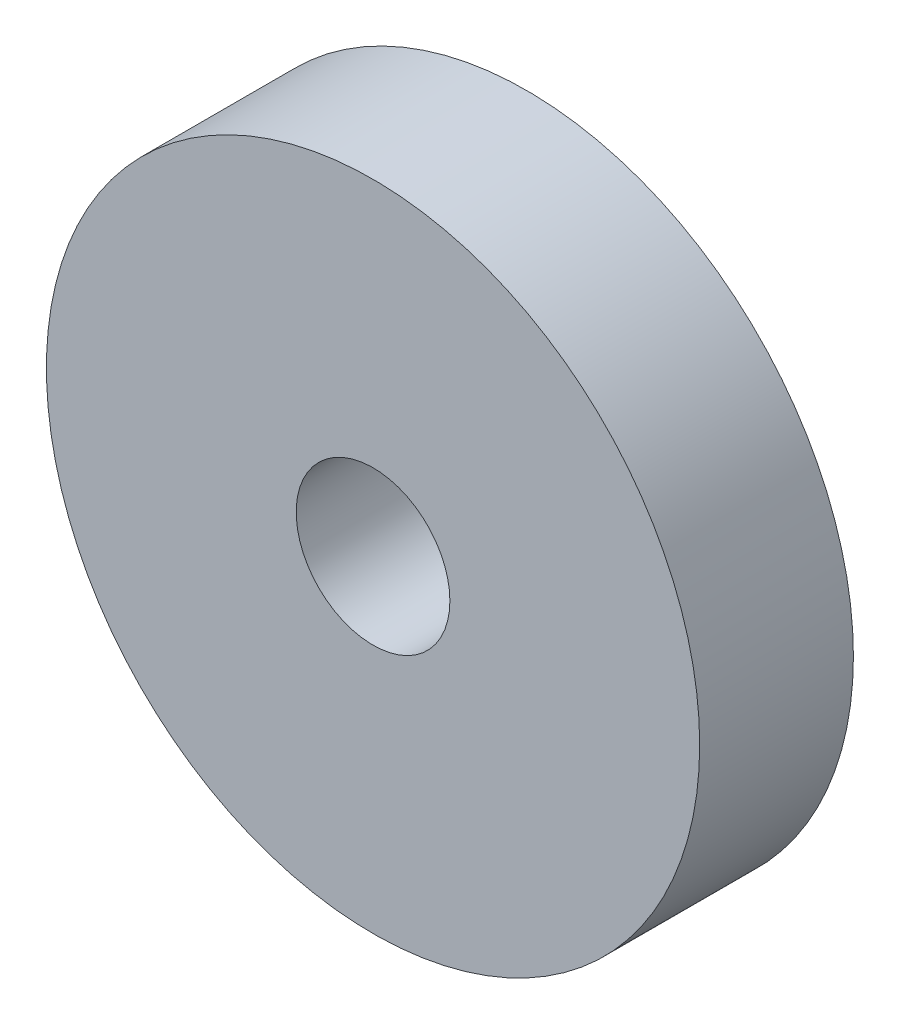
ISO-10303-21;
HEADER;
FILE_DESCRIPTION(('STEP AP214'),'2;1');
FILE_NAME('part.step','',(''),(''),'','','');
FILE_SCHEMA(('AUTOMOTIVE_DESIGN { 1 0 10303 214 1 1 1 1 }'));
ENDSEC;
DATA;
#1=APPLICATION_CONTEXT('core data for automotive mechanical design processes');
#2=APPLICATION_PROTOCOL_DEFINITION('international standard','automotive_design',2000,#1);
#3=PRODUCT_CONTEXT('',#1,'mechanical');
#4=PRODUCT('Part','Part','',(#3));
#5=PRODUCT_RELATED_PRODUCT_CATEGORY('part','',(#4));
#6=PRODUCT_DEFINITION_FORMATION('','',#4);
#7=PRODUCT_DEFINITION_CONTEXT('part definition',#1,'design');
#8=PRODUCT_DEFINITION('design','',#6,#7);
#9=PRODUCT_DEFINITION_SHAPE('','',#8);
#10=(LENGTH_UNIT() NAMED_UNIT(*) SI_UNIT(.MILLI.,.METRE.));
#11=(NAMED_UNIT(*) PLANE_ANGLE_UNIT() SI_UNIT($,.RADIAN.));
#12=(NAMED_UNIT(*) SI_UNIT($,.STERADIAN.) SOLID_ANGLE_UNIT());
#13=UNCERTAINTY_MEASURE_WITH_UNIT(LENGTH_MEASURE(1.E-05),#10,'distance_accuracy_value','');
#14=(GEOMETRIC_REPRESENTATION_CONTEXT(3) GLOBAL_UNCERTAINTY_ASSIGNED_CONTEXT((#13)) GLOBAL_UNIT_ASSIGNED_CONTEXT((#10,
#11,#12)) REPRESENTATION_CONTEXT('',''));
#15=CARTESIAN_POINT('',(0.,0.,0.));
#16=DIRECTION('',(0.,0.,1.));
#17=DIRECTION('',(1.,0.,0.));
#18=AXIS2_PLACEMENT_3D('',#15,#16,#17);
#19=CARTESIAN_POINT('',(0.,0.,1.));
#20=DIRECTION('',(0.,0.,1.));
#21=DIRECTION('',(1.,0.,0.));
#22=AXIS2_PLACEMENT_3D('',#19,#20,#21);
#23=PLANE('',#22);
#24=CARTESIAN_POINT('',(0.,0.,1.));
#25=DIRECTION('',(0.,0.,1.));
#26=DIRECTION('',(1.,0.,0.));
#27=AXIS2_PLACEMENT_3D('',#24,#25,#26);
#28=CIRCLE('',#27,2.125);
#29=CARTESIAN_POINT('',(2.125,0.,1.));
#30=VERTEX_POINT('',#29);
#31=EDGE_CURVE('E10',#30,#30,#28,.T.);
#32=ORIENTED_EDGE('',*,*,#31,.T.);
#33=EDGE_LOOP('',(#32));
#34=FACE_BOUND('',#33,.T.);
#35=CARTESIAN_POINT('',(0.,0.,1.));
#36=DIRECTION('',(0.,0.,1.));
#37=DIRECTION('',(1.,0.,0.));
#38=AXIS2_PLACEMENT_3D('',#35,#36,#37);
#39=CIRCLE('',#38,0.5);
#40=CARTESIAN_POINT('',(0.5,0.,1.));
#41=VERTEX_POINT('',#40);
#42=EDGE_CURVE('E43',#41,#41,#39,.T.);
#43=ORIENTED_EDGE('',*,*,#42,.F.);
#44=EDGE_LOOP('',(#43));
#45=FACE_BOUND('',#44,.T.);
#46=ADVANCED_FACE('F32',(#34,#45),#23,.T.);
#47=CARTESIAN_POINT('',(0.,0.,0.));
#48=DIRECTION('',(0.,0.,1.));
#49=DIRECTION('',(1.,0.,0.));
#50=AXIS2_PLACEMENT_3D('',#47,#48,#49);
#51=PLANE('',#50);
#52=CARTESIAN_POINT('',(0.,0.,0.));
#53=DIRECTION('',(0.,0.,1.));
#54=DIRECTION('',(1.,0.,0.));
#55=AXIS2_PLACEMENT_3D('',#52,#53,#54);
#56=CIRCLE('',#55,2.125);
#57=CARTESIAN_POINT('',(2.125,0.,0.));
#58=VERTEX_POINT('',#57);
#59=EDGE_CURVE('E36',#58,#58,#56,.T.);
#60=ORIENTED_EDGE('',*,*,#59,.F.);
#61=EDGE_LOOP('',(#60));
#62=FACE_BOUND('',#61,.T.);
#63=CARTESIAN_POINT('',(0.,0.,0.));
#64=DIRECTION('',(0.,0.,1.));
#65=DIRECTION('',(1.,0.,0.));
#66=AXIS2_PLACEMENT_3D('',#63,#64,#65);
#67=CIRCLE('',#66,0.5);
#68=CARTESIAN_POINT('',(0.5,0.,0.));
#69=VERTEX_POINT('',#68);
#70=EDGE_CURVE('E45',#69,#69,#67,.T.);
#71=ORIENTED_EDGE('',*,*,#70,.T.);
#72=EDGE_LOOP('',(#71));
#73=FACE_BOUND('',#72,.T.);
#74=ADVANCED_FACE('F55',(#62,#73),#51,.F.);
#75=CARTESIAN_POINT('',(0.,0.,1.));
#76=DIRECTION('',(0.,0.,-1.));
#77=DIRECTION('',(-1.,0.,0.));
#78=AXIS2_PLACEMENT_3D('',#75,#76,#77);
#79=CYLINDRICAL_SURFACE('',#78,2.125);
#80=ORIENTED_EDGE('',*,*,#31,.F.);
#81=EDGE_LOOP('',(#80));
#82=FACE_BOUND('',#81,.T.);
#83=ORIENTED_EDGE('',*,*,#59,.T.);
#84=EDGE_LOOP('',(#83));
#85=FACE_BOUND('',#84,.T.);
#86=ADVANCED_FACE('F34',(#82,#85),#79,.T.);
#87=CARTESIAN_POINT('',(0.,0.,1.));
#88=DIRECTION('',(0.,0.,-1.));
#89=DIRECTION('',(-1.,0.,0.));
#90=AXIS2_PLACEMENT_3D('',#87,#88,#89);
#91=CYLINDRICAL_SURFACE('',#90,0.5);
#92=ORIENTED_EDGE('',*,*,#42,.T.);
#93=EDGE_LOOP('',(#92));
#94=FACE_BOUND('',#93,.T.);
#95=ORIENTED_EDGE('',*,*,#70,.F.);
#96=EDGE_LOOP('',(#95));
#97=FACE_BOUND('',#96,.T.);
#98=ADVANCED_FACE('F51',(#94,#97),#91,.F.);
#99=CLOSED_SHELL('',(#46,#74,#86,#98));
#100=MANIFOLD_SOLID_BREP('B2',#99);
#101=ADVANCED_BREP_SHAPE_REPRESENTATION('',(#18,#100),#14);
#102=SHAPE_DEFINITION_REPRESENTATION(#9,#101);
ENDSEC;
END-ISO-10303-21;
